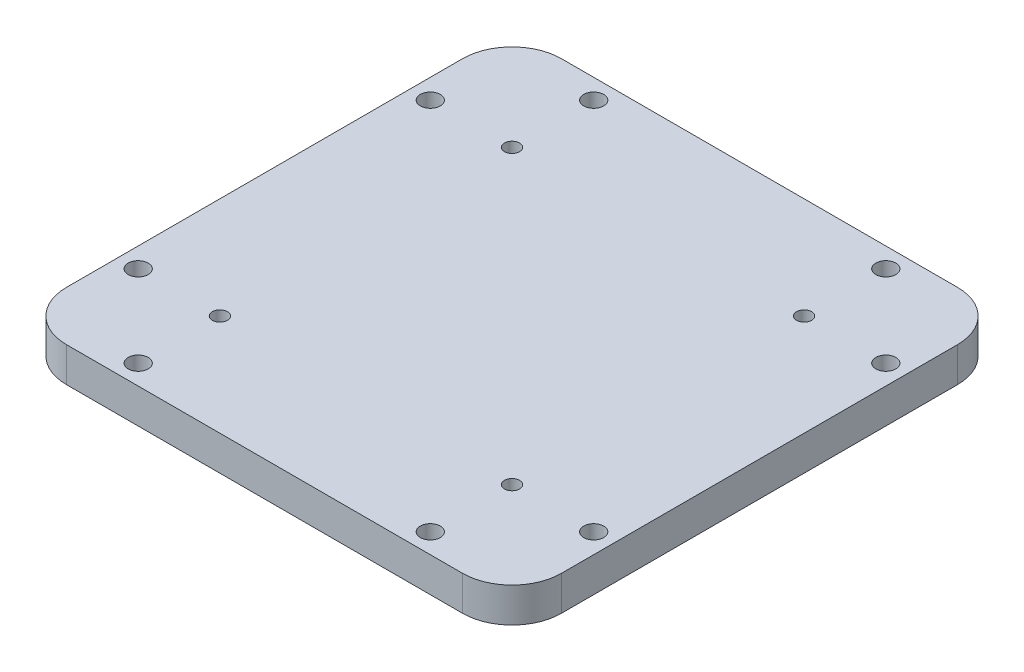
ISO-10303-21;
HEADER;
FILE_DESCRIPTION(('STEP AP214'),'2;1');
FILE_NAME('part.step','',(''),(''),'','','');
FILE_SCHEMA(('AUTOMOTIVE_DESIGN { 1 0 10303 214 1 1 1 1 }'));
ENDSEC;
DATA;
#1=APPLICATION_CONTEXT('core data for automotive mechanical design processes');
#2=APPLICATION_PROTOCOL_DEFINITION('international standard','automotive_design',2000,#1);
#3=PRODUCT_CONTEXT('',#1,'mechanical');
#4=PRODUCT('Part','Part','',(#3));
#5=PRODUCT_RELATED_PRODUCT_CATEGORY('part','',(#4));
#6=PRODUCT_DEFINITION_FORMATION('','',#4);
#7=PRODUCT_DEFINITION_CONTEXT('part definition',#1,'design');
#8=PRODUCT_DEFINITION('design','',#6,#7);
#9=PRODUCT_DEFINITION_SHAPE('','',#8);
#10=(LENGTH_UNIT() NAMED_UNIT(*) SI_UNIT(.MILLI.,.METRE.));
#11=(NAMED_UNIT(*) PLANE_ANGLE_UNIT() SI_UNIT($,.RADIAN.));
#12=(NAMED_UNIT(*) SI_UNIT($,.STERADIAN.) SOLID_ANGLE_UNIT());
#13=UNCERTAINTY_MEASURE_WITH_UNIT(LENGTH_MEASURE(1.E-05),#10,'distance_accuracy_value','');
#14=(GEOMETRIC_REPRESENTATION_CONTEXT(3) GLOBAL_UNCERTAINTY_ASSIGNED_CONTEXT((#13)) GLOBAL_UNIT_ASSIGNED_CONTEXT((#10,
#11,#12)) REPRESENTATION_CONTEXT('',''));
#15=CARTESIAN_POINT('',(0.,0.,0.));
#16=DIRECTION('',(0.,0.,1.));
#17=DIRECTION('',(1.,0.,0.));
#18=AXIS2_PLACEMENT_3D('',#15,#16,#17);
#19=CARTESIAN_POINT('',(0.,7.,0.));
#20=DIRECTION('',(0.,1.,0.));
#21=DIRECTION('',(0.,0.,1.));
#22=AXIS2_PLACEMENT_3D('',#19,#20,#21);
#23=PLANE('',#22);
#24=CARTESIAN_POINT('',(79.5,7.,-96.));
#25=DIRECTION('',(0.,1.,0.));
#26=DIRECTION('',(0.,0.,1.));
#27=AXIS2_PLACEMENT_3D('',#24,#25,#26);
#28=CIRCLE('',#27,2.02);
#29=CARTESIAN_POINT('',(79.5,7.,-93.98));
#30=VERTEX_POINT('',#29);
#31=EDGE_CURVE('E224',#30,#30,#28,.F.);
#32=ORIENTED_EDGE('',*,*,#31,.T.);
#33=EDGE_LOOP('',(#32));
#34=FACE_BOUND('',#33,.T.);
#35=CARTESIAN_POINT('',(20.5,7.,-20.5));
#36=DIRECTION('',(0.,1.,0.));
#37=DIRECTION('',(0.,0.,1.));
#38=AXIS2_PLACEMENT_3D('',#35,#36,#37);
#39=CIRCLE('',#38,1.52);
#40=CARTESIAN_POINT('',(20.5,7.,-18.98));
#41=VERTEX_POINT('',#40);
#42=EDGE_CURVE('E245',#41,#41,#39,.F.);
#43=ORIENTED_EDGE('',*,*,#42,.T.);
#44=EDGE_LOOP('',(#43));
#45=FACE_BOUND('',#44,.T.);
#46=CARTESIAN_POINT('',(20.5,7.,-4.));
#47=DIRECTION('',(0.,1.,0.));
#48=DIRECTION('',(0.,0.,1.));
#49=AXIS2_PLACEMENT_3D('',#46,#47,#48);
#50=CIRCLE('',#49,2.02);
#51=CARTESIAN_POINT('',(20.5,7.,-1.98));
#52=VERTEX_POINT('',#51);
#53=EDGE_CURVE('E248',#52,#52,#50,.F.);
#54=ORIENTED_EDGE('',*,*,#53,.T.);
#55=EDGE_LOOP('',(#54));
#56=FACE_BOUND('',#55,.T.);
#57=CARTESIAN_POINT('',(4.,7.,-79.5));
#58=DIRECTION('',(0.,1.,0.));
#59=DIRECTION('',(0.,0.,1.));
#60=AXIS2_PLACEMENT_3D('',#57,#58,#59);
#61=CIRCLE('',#60,2.02);
#62=CARTESIAN_POINT('',(4.,7.,-77.48));
#63=VERTEX_POINT('',#62);
#64=EDGE_CURVE('E164',#63,#63,#61,.T.);
#65=ORIENTED_EDGE('',*,*,#64,.F.);
#66=EDGE_LOOP('',(#65));
#67=FACE_BOUND('',#66,.T.);
#68=DIRECTION('',(1.,0.,0.));
#69=VECTOR('',#68,1.);
#70=CARTESIAN_POINT('',(0.,7.,-100.));
#71=LINE('',#70,#69);
#72=CARTESIAN_POINT('',(10.,7.,-100.));
#73=VERTEX_POINT('',#72);
#74=CARTESIAN_POINT('',(90.,7.,-100.));
#75=VERTEX_POINT('',#74);
#76=EDGE_CURVE('E135',#73,#75,#71,.T.);
#77=ORIENTED_EDGE('',*,*,#76,.F.);
#78=CARTESIAN_POINT('',(10.,7.,-90.));
#79=DIRECTION('',(0.,1.,0.));
#80=DIRECTION('',(0.,0.,1.));
#81=AXIS2_PLACEMENT_3D('',#78,#79,#80);
#82=CIRCLE('',#81,10.);
#83=CARTESIAN_POINT('',(0.,7.,-90.));
#84=VERTEX_POINT('',#83);
#85=EDGE_CURVE('E153',#73,#84,#82,.T.);
#86=ORIENTED_EDGE('',*,*,#85,.T.);
#87=DIRECTION('',(0.,0.,-1.));
#88=VECTOR('',#87,1.);
#89=CARTESIAN_POINT('',(0.,7.,0.));
#90=LINE('',#89,#88);
#91=CARTESIAN_POINT('',(0.,7.,-10.));
#92=VERTEX_POINT('',#91);
#93=EDGE_CURVE('E132',#92,#84,#90,.T.);
#94=ORIENTED_EDGE('',*,*,#93,.F.);
#95=CARTESIAN_POINT('',(10.,7.,-10.));
#96=DIRECTION('',(0.,1.,0.));
#97=DIRECTION('',(0.,0.,1.));
#98=AXIS2_PLACEMENT_3D('',#95,#96,#97);
#99=CIRCLE('',#98,10.);
#100=CARTESIAN_POINT('',(10.,7.,0.));
#101=VERTEX_POINT('',#100);
#102=EDGE_CURVE('E131',#92,#101,#99,.T.);
#103=ORIENTED_EDGE('',*,*,#102,.T.);
#104=DIRECTION('',(1.,0.,0.));
#105=VECTOR('',#104,1.);
#106=CARTESIAN_POINT('',(0.,7.,0.));
#107=LINE('',#106,#105);
#108=CARTESIAN_POINT('',(90.,7.,0.));
#109=VERTEX_POINT('',#108);
#110=EDGE_CURVE('E127',#101,#109,#107,.T.);
#111=ORIENTED_EDGE('',*,*,#110,.T.);
#112=CARTESIAN_POINT('',(90.0000000000001,7.,-10.));
#113=DIRECTION('',(0.,1.,0.));
#114=DIRECTION('',(0.,0.,1.));
#115=AXIS2_PLACEMENT_3D('',#112,#113,#114);
#116=CIRCLE('',#115,10.);
#117=CARTESIAN_POINT('',(100.,7.,-10.));
#118=VERTEX_POINT('',#117);
#119=EDGE_CURVE('E62',#109,#118,#116,.T.);
#120=ORIENTED_EDGE('',*,*,#119,.T.);
#121=DIRECTION('',(0.,0.,-1.));
#122=VECTOR('',#121,1.);
#123=CARTESIAN_POINT('',(100.,7.,0.));
#124=LINE('',#123,#122);
#125=CARTESIAN_POINT('',(100.,7.,-90.));
#126=VERTEX_POINT('',#125);
#127=EDGE_CURVE('E217',#118,#126,#124,.T.);
#128=ORIENTED_EDGE('',*,*,#127,.T.);
#129=CARTESIAN_POINT('',(90.,7.,-90.));
#130=DIRECTION('',(0.,1.,0.));
#131=DIRECTION('',(0.,0.,1.));
#132=AXIS2_PLACEMENT_3D('',#129,#130,#131);
#133=CIRCLE('',#132,10.);
#134=EDGE_CURVE('E151',#126,#75,#133,.T.);
#135=ORIENTED_EDGE('',*,*,#134,.T.);
#136=EDGE_LOOP('',(#77,#86,#94,#103,#111,#120,#128,#135));
#137=FACE_BOUND('',#136,.T.);
#138=CARTESIAN_POINT('',(4.,7.,-20.5));
#139=DIRECTION('',(0.,1.,0.));
#140=DIRECTION('',(0.,0.,1.));
#141=AXIS2_PLACEMENT_3D('',#138,#139,#140);
#142=CIRCLE('',#141,2.02);
#143=CARTESIAN_POINT('',(4.,7.,-18.48));
#144=VERTEX_POINT('',#143);
#145=EDGE_CURVE('E251',#144,#144,#142,.F.);
#146=ORIENTED_EDGE('',*,*,#145,.T.);
#147=EDGE_LOOP('',(#146));
#148=FACE_BOUND('',#147,.T.);
#149=CARTESIAN_POINT('',(20.5,7.,-96.));
#150=DIRECTION('',(0.,1.,0.));
#151=DIRECTION('',(0.,0.,1.));
#152=AXIS2_PLACEMENT_3D('',#149,#150,#151);
#153=CIRCLE('',#152,2.02);
#154=CARTESIAN_POINT('',(20.5,7.,-93.98));
#155=VERTEX_POINT('',#154);
#156=EDGE_CURVE('E223',#155,#155,#153,.T.);
#157=ORIENTED_EDGE('',*,*,#156,.F.);
#158=EDGE_LOOP('',(#157));
#159=FACE_BOUND('',#158,.T.);
#160=CARTESIAN_POINT('',(20.5,7.,-79.5));
#161=DIRECTION('',(0.,1.,0.));
#162=DIRECTION('',(0.,0.,1.));
#163=AXIS2_PLACEMENT_3D('',#160,#161,#162);
#164=CIRCLE('',#163,1.52);
#165=CARTESIAN_POINT('',(20.5,7.,-77.98));
#166=VERTEX_POINT('',#165);
#167=EDGE_CURVE('E231',#166,#166,#164,.T.);
#168=ORIENTED_EDGE('',*,*,#167,.F.);
#169=EDGE_LOOP('',(#168));
#170=FACE_BOUND('',#169,.T.);
#171=CARTESIAN_POINT('',(79.5,7.,-79.5));
#172=DIRECTION('',(0.,1.,0.));
#173=DIRECTION('',(0.,0.,1.));
#174=AXIS2_PLACEMENT_3D('',#171,#172,#173);
#175=CIRCLE('',#174,1.51999999999999);
#176=CARTESIAN_POINT('',(79.5,7.,-77.98));
#177=VERTEX_POINT('',#176);
#178=EDGE_CURVE('E227',#177,#177,#175,.F.);
#179=ORIENTED_EDGE('',*,*,#178,.T.);
#180=EDGE_LOOP('',(#179));
#181=FACE_BOUND('',#180,.T.);
#182=CARTESIAN_POINT('',(79.5,7.,-4.00000000000001));
#183=DIRECTION('',(0.,1.,0.));
#184=DIRECTION('',(0.,0.,1.));
#185=AXIS2_PLACEMENT_3D('',#182,#183,#184);
#186=CIRCLE('',#185,2.02);
#187=CARTESIAN_POINT('',(79.5,7.,-1.98000000000001));
#188=VERTEX_POINT('',#187);
#189=EDGE_CURVE('E242',#188,#188,#186,.T.);
#190=ORIENTED_EDGE('',*,*,#189,.F.);
#191=EDGE_LOOP('',(#190));
#192=FACE_BOUND('',#191,.T.);
#193=CARTESIAN_POINT('',(96.,7.,-20.5));
#194=DIRECTION('',(0.,1.,0.));
#195=DIRECTION('',(0.,0.,1.));
#196=AXIS2_PLACEMENT_3D('',#193,#194,#195);
#197=CIRCLE('',#196,2.02);
#198=CARTESIAN_POINT('',(96.,7.,-18.48));
#199=VERTEX_POINT('',#198);
#200=EDGE_CURVE('E239',#199,#199,#197,.T.);
#201=ORIENTED_EDGE('',*,*,#200,.F.);
#202=EDGE_LOOP('',(#201));
#203=FACE_BOUND('',#202,.T.);
#204=CARTESIAN_POINT('',(79.5,7.,-20.5));
#205=DIRECTION('',(0.,1.,0.));
#206=DIRECTION('',(0.,0.,1.));
#207=AXIS2_PLACEMENT_3D('',#204,#205,#206);
#208=CIRCLE('',#207,1.52000000000001);
#209=CARTESIAN_POINT('',(79.5,7.,-18.98));
#210=VERTEX_POINT('',#209);
#211=EDGE_CURVE('E236',#210,#210,#208,.T.);
#212=ORIENTED_EDGE('',*,*,#211,.F.);
#213=EDGE_LOOP('',(#212));
#214=FACE_BOUND('',#213,.T.);
#215=CARTESIAN_POINT('',(96.,7.,-79.5));
#216=DIRECTION('',(0.,1.,0.));
#217=DIRECTION('',(0.,0.,1.));
#218=AXIS2_PLACEMENT_3D('',#215,#216,#217);
#219=CIRCLE('',#218,2.02);
#220=CARTESIAN_POINT('',(96.,7.,-77.48));
#221=VERTEX_POINT('',#220);
#222=EDGE_CURVE('E228',#221,#221,#219,.F.);
#223=ORIENTED_EDGE('',*,*,#222,.T.);
#224=EDGE_LOOP('',(#223));
#225=FACE_BOUND('',#224,.T.);
#226=ADVANCED_FACE('F38',(#34,#45,#56,#67,#137,#148,#159,#170,#181,#192,#203,#214,#225),#23,.T.);
#227=CARTESIAN_POINT('',(0.,0.,0.));
#228=DIRECTION('',(0.,1.,0.));
#229=DIRECTION('',(0.,0.,1.));
#230=AXIS2_PLACEMENT_3D('',#227,#228,#229);
#231=PLANE('',#230);
#232=CARTESIAN_POINT('',(79.5,0.,-20.5));
#233=DIRECTION('',(0.,1.,0.));
#234=DIRECTION('',(0.,0.,1.));
#235=AXIS2_PLACEMENT_3D('',#232,#233,#234);
#236=CIRCLE('',#235,1.52000000000001);
#237=CARTESIAN_POINT('',(79.5,0.,-18.98));
#238=VERTEX_POINT('',#237);
#239=EDGE_CURVE('E190',#238,#238,#236,.T.);
#240=ORIENTED_EDGE('',*,*,#239,.T.);
#241=EDGE_LOOP('',(#240));
#242=FACE_BOUND('',#241,.T.);
#243=CARTESIAN_POINT('',(96.,0.,-20.5));
#244=DIRECTION('',(0.,1.,0.));
#245=DIRECTION('',(0.,0.,1.));
#246=AXIS2_PLACEMENT_3D('',#243,#244,#245);
#247=CIRCLE('',#246,2.02);
#248=CARTESIAN_POINT('',(96.,0.,-18.48));
#249=VERTEX_POINT('',#248);
#250=EDGE_CURVE('E188',#249,#249,#247,.T.);
#251=ORIENTED_EDGE('',*,*,#250,.T.);
#252=EDGE_LOOP('',(#251));
#253=FACE_BOUND('',#252,.T.);
#254=CARTESIAN_POINT('',(79.5,0.,-4.00000000000001));
#255=DIRECTION('',(0.,1.,0.));
#256=DIRECTION('',(0.,0.,1.));
#257=AXIS2_PLACEMENT_3D('',#254,#255,#256);
#258=CIRCLE('',#257,2.02);
#259=CARTESIAN_POINT('',(79.5,0.,-1.98000000000001));
#260=VERTEX_POINT('',#259);
#261=EDGE_CURVE('E185',#260,#260,#258,.T.);
#262=ORIENTED_EDGE('',*,*,#261,.T.);
#263=EDGE_LOOP('',(#262));
#264=FACE_BOUND('',#263,.T.);
#265=CARTESIAN_POINT('',(20.5,0.,-79.5));
#266=DIRECTION('',(0.,1.,0.));
#267=DIRECTION('',(0.,0.,1.));
#268=AXIS2_PLACEMENT_3D('',#265,#266,#267);
#269=CIRCLE('',#268,1.52);
#270=CARTESIAN_POINT('',(20.5,0.,-77.98));
#271=VERTEX_POINT('',#270);
#272=EDGE_CURVE('E176',#271,#271,#269,.T.);
#273=ORIENTED_EDGE('',*,*,#272,.T.);
#274=EDGE_LOOP('',(#273));
#275=FACE_BOUND('',#274,.T.);
#276=CARTESIAN_POINT('',(20.5,0.,-96.));
#277=DIRECTION('',(0.,1.,0.));
#278=DIRECTION('',(0.,0.,1.));
#279=AXIS2_PLACEMENT_3D('',#276,#277,#278);
#280=CIRCLE('',#279,2.02);
#281=CARTESIAN_POINT('',(20.5,0.,-93.98));
#282=VERTEX_POINT('',#281);
#283=EDGE_CURVE('E173',#282,#282,#280,.T.);
#284=ORIENTED_EDGE('',*,*,#283,.T.);
#285=EDGE_LOOP('',(#284));
#286=FACE_BOUND('',#285,.T.);
#287=CARTESIAN_POINT('',(4.,0.,-79.5));
#288=DIRECTION('',(0.,1.,0.));
#289=DIRECTION('',(0.,0.,1.));
#290=AXIS2_PLACEMENT_3D('',#287,#288,#289);
#291=CIRCLE('',#290,2.02);
#292=CARTESIAN_POINT('',(4.,0.,-77.48));
#293=VERTEX_POINT('',#292);
#294=EDGE_CURVE('E160',#293,#293,#291,.T.);
#295=ORIENTED_EDGE('',*,*,#294,.T.);
#296=EDGE_LOOP('',(#295));
#297=FACE_BOUND('',#296,.T.);
#298=DIRECTION('',(0.,0.,-1.));
#299=VECTOR('',#298,1.);
#300=CARTESIAN_POINT('',(0.,0.,0.));
#301=LINE('',#300,#299);
#302=CARTESIAN_POINT('',(0.,0.,-10.));
#303=VERTEX_POINT('',#302);
#304=CARTESIAN_POINT('',(0.,0.,-90.));
#305=VERTEX_POINT('',#304);
#306=EDGE_CURVE('E110',#303,#305,#301,.T.);
#307=ORIENTED_EDGE('',*,*,#306,.T.);
#308=CARTESIAN_POINT('',(10.,0.,-90.));
#309=DIRECTION('',(0.,1.,0.));
#310=DIRECTION('',(0.,0.,1.));
#311=AXIS2_PLACEMENT_3D('',#308,#309,#310);
#312=CIRCLE('',#311,10.);
#313=CARTESIAN_POINT('',(10.,0.,-100.));
#314=VERTEX_POINT('',#313);
#315=EDGE_CURVE('E142',#305,#314,#312,.F.);
#316=ORIENTED_EDGE('',*,*,#315,.T.);
#317=DIRECTION('',(1.,0.,0.));
#318=VECTOR('',#317,1.);
#319=CARTESIAN_POINT('',(0.,0.,-100.));
#320=LINE('',#319,#318);
#321=CARTESIAN_POINT('',(90.,0.,-100.));
#322=VERTEX_POINT('',#321);
#323=EDGE_CURVE('E128',#314,#322,#320,.T.);
#324=ORIENTED_EDGE('',*,*,#323,.T.);
#325=CARTESIAN_POINT('',(90.,0.,-90.));
#326=DIRECTION('',(0.,1.,0.));
#327=DIRECTION('',(0.,0.,1.));
#328=AXIS2_PLACEMENT_3D('',#325,#326,#327);
#329=CIRCLE('',#328,10.);
#330=CARTESIAN_POINT('',(100.,0.,-90.));
#331=VERTEX_POINT('',#330);
#332=EDGE_CURVE('E140',#322,#331,#329,.F.);
#333=ORIENTED_EDGE('',*,*,#332,.T.);
#334=DIRECTION('',(0.,0.,-1.));
#335=VECTOR('',#334,1.);
#336=CARTESIAN_POINT('',(100.,0.,0.));
#337=LINE('',#336,#335);
#338=CARTESIAN_POINT('',(100.,0.,-10.));
#339=VERTEX_POINT('',#338);
#340=EDGE_CURVE('E197',#339,#331,#337,.T.);
#341=ORIENTED_EDGE('',*,*,#340,.F.);
#342=CARTESIAN_POINT('',(90.0000000000001,0.,-10.));
#343=DIRECTION('',(0.,1.,0.));
#344=DIRECTION('',(0.,0.,1.));
#345=AXIS2_PLACEMENT_3D('',#342,#343,#344);
#346=CIRCLE('',#345,10.);
#347=CARTESIAN_POINT('',(90.,0.,0.));
#348=VERTEX_POINT('',#347);
#349=EDGE_CURVE('E117',#339,#348,#346,.F.);
#350=ORIENTED_EDGE('',*,*,#349,.T.);
#351=DIRECTION('',(1.,0.,0.));
#352=VECTOR('',#351,1.);
#353=CARTESIAN_POINT('',(0.,0.,0.));
#354=LINE('',#353,#352);
#355=CARTESIAN_POINT('',(10.,0.,0.));
#356=VERTEX_POINT('',#355);
#357=EDGE_CURVE('E112',#356,#348,#354,.T.);
#358=ORIENTED_EDGE('',*,*,#357,.F.);
#359=CARTESIAN_POINT('',(10.,0.,-10.));
#360=DIRECTION('',(0.,1.,0.));
#361=DIRECTION('',(0.,0.,1.));
#362=AXIS2_PLACEMENT_3D('',#359,#360,#361);
#363=CIRCLE('',#362,10.);
#364=EDGE_CURVE('E106',#356,#303,#363,.F.);
#365=ORIENTED_EDGE('',*,*,#364,.T.);
#366=EDGE_LOOP('',(#307,#316,#324,#333,#341,#350,#358,#365));
#367=FACE_BOUND('',#366,.T.);
#368=CARTESIAN_POINT('',(20.5,0.,-4.));
#369=DIRECTION('',(0.,1.,0.));
#370=DIRECTION('',(0.,0.,1.));
#371=AXIS2_PLACEMENT_3D('',#368,#369,#370);
#372=CIRCLE('',#371,2.02);
#373=CARTESIAN_POINT('',(20.5,0.,-1.98));
#374=VERTEX_POINT('',#373);
#375=EDGE_CURVE('E163',#374,#374,#372,.F.);
#376=ORIENTED_EDGE('',*,*,#375,.F.);
#377=EDGE_LOOP('',(#376));
#378=FACE_BOUND('',#377,.T.);
#379=CARTESIAN_POINT('',(4.,0.,-20.5));
#380=DIRECTION('',(0.,1.,0.));
#381=DIRECTION('',(0.,0.,1.));
#382=AXIS2_PLACEMENT_3D('',#379,#380,#381);
#383=CIRCLE('',#382,2.02);
#384=CARTESIAN_POINT('',(4.,0.,-18.48));
#385=VERTEX_POINT('',#384);
#386=EDGE_CURVE('E167',#385,#385,#383,.F.);
#387=ORIENTED_EDGE('',*,*,#386,.F.);
#388=EDGE_LOOP('',(#387));
#389=FACE_BOUND('',#388,.T.);
#390=CARTESIAN_POINT('',(20.5,0.,-20.5));
#391=DIRECTION('',(0.,1.,0.));
#392=DIRECTION('',(0.,0.,1.));
#393=AXIS2_PLACEMENT_3D('',#390,#391,#392);
#394=CIRCLE('',#393,1.52);
#395=CARTESIAN_POINT('',(20.5,0.,-18.98));
#396=VERTEX_POINT('',#395);
#397=EDGE_CURVE('E170',#396,#396,#394,.F.);
#398=ORIENTED_EDGE('',*,*,#397,.F.);
#399=EDGE_LOOP('',(#398));
#400=FACE_BOUND('',#399,.T.);
#401=CARTESIAN_POINT('',(79.5,0.,-79.5));
#402=DIRECTION('',(0.,1.,0.));
#403=DIRECTION('',(0.,0.,1.));
#404=AXIS2_PLACEMENT_3D('',#401,#402,#403);
#405=CIRCLE('',#404,1.51999999999999);
#406=CARTESIAN_POINT('',(79.5,0.,-77.98));
#407=VERTEX_POINT('',#406);
#408=EDGE_CURVE('E179',#407,#407,#405,.F.);
#409=ORIENTED_EDGE('',*,*,#408,.F.);
#410=EDGE_LOOP('',(#409));
#411=FACE_BOUND('',#410,.T.);
#412=CARTESIAN_POINT('',(79.5,0.,-96.));
#413=DIRECTION('',(0.,1.,0.));
#414=DIRECTION('',(0.,0.,1.));
#415=AXIS2_PLACEMENT_3D('',#412,#413,#414);
#416=CIRCLE('',#415,2.02);
#417=CARTESIAN_POINT('',(79.5,0.,-93.98));
#418=VERTEX_POINT('',#417);
#419=EDGE_CURVE('E182',#418,#418,#416,.F.);
#420=ORIENTED_EDGE('',*,*,#419,.F.);
#421=EDGE_LOOP('',(#420));
#422=FACE_BOUND('',#421,.T.);
#423=CARTESIAN_POINT('',(96.,0.,-79.5));
#424=DIRECTION('',(0.,1.,0.));
#425=DIRECTION('',(0.,0.,1.));
#426=AXIS2_PLACEMENT_3D('',#423,#424,#425);
#427=CIRCLE('',#426,2.02);
#428=CARTESIAN_POINT('',(96.,0.,-77.48));
#429=VERTEX_POINT('',#428);
#430=EDGE_CURVE('E42',#429,#429,#427,.F.);
#431=ORIENTED_EDGE('',*,*,#430,.F.);
#432=EDGE_LOOP('',(#431));
#433=FACE_BOUND('',#432,.T.);
#434=ADVANCED_FACE('F108',(#242,#253,#264,#275,#286,#297,#367,#378,#389,#400,#411,#422,#433),
#231,.F.);
#435=CARTESIAN_POINT('',(0.,7.,0.));
#436=DIRECTION('',(0.,0.,-1.));
#437=DIRECTION('',(-1.,0.,0.));
#438=AXIS2_PLACEMENT_3D('',#435,#436,#437);
#439=PLANE('',#438);
#440=ORIENTED_EDGE('',*,*,#357,.T.);
#441=DIRECTION('',(0.,-1.,0.));
#442=VECTOR('',#441,1.);
#443=CARTESIAN_POINT('',(90.0000000000001,7.,0.));
#444=LINE('',#443,#442);
#445=EDGE_CURVE('E11',#348,#109,#444,.F.);
#446=ORIENTED_EDGE('',*,*,#445,.T.);
#447=ORIENTED_EDGE('',*,*,#110,.F.);
#448=DIRECTION('',(0.,-1.,0.));
#449=VECTOR('',#448,1.);
#450=CARTESIAN_POINT('',(10.,0.,0.));
#451=LINE('',#450,#449);
#452=EDGE_CURVE('E47',#101,#356,#451,.T.);
#453=ORIENTED_EDGE('',*,*,#452,.T.);
#454=EDGE_LOOP('',(#440,#446,#447,#453));
#455=FACE_BOUND('',#454,.T.);
#456=ADVANCED_FACE('F269',(#455),#439,.F.);
#457=CARTESIAN_POINT('',(100.,7.,0.));
#458=DIRECTION('',(-1.,0.,0.));
#459=DIRECTION('',(0.,0.,1.));
#460=AXIS2_PLACEMENT_3D('',#457,#458,#459);
#461=PLANE('',#460);
#462=ORIENTED_EDGE('',*,*,#340,.T.);
#463=DIRECTION('',(0.,-1.,0.));
#464=VECTOR('',#463,1.);
#465=CARTESIAN_POINT('',(100.,7.,-90.));
#466=LINE('',#465,#464);
#467=EDGE_CURVE('E55',#331,#126,#466,.F.);
#468=ORIENTED_EDGE('',*,*,#467,.T.);
#469=ORIENTED_EDGE('',*,*,#127,.F.);
#470=DIRECTION('',(0.,-1.,0.));
#471=VECTOR('',#470,1.);
#472=CARTESIAN_POINT('',(100.,7.,-10.));
#473=LINE('',#472,#471);
#474=EDGE_CURVE('E155',#118,#339,#473,.T.);
#475=ORIENTED_EDGE('',*,*,#474,.T.);
#476=EDGE_LOOP('',(#462,#468,#469,#475));
#477=FACE_BOUND('',#476,.T.);
#478=ADVANCED_FACE('F305',(#477),#461,.F.);
#479=CARTESIAN_POINT('',(0.,7.,-100.));
#480=DIRECTION('',(0.,0.,-1.));
#481=DIRECTION('',(-1.,0.,0.));
#482=AXIS2_PLACEMENT_3D('',#479,#480,#481);
#483=PLANE('',#482);
#484=ORIENTED_EDGE('',*,*,#323,.F.);
#485=DIRECTION('',(0.,-1.,0.));
#486=VECTOR('',#485,1.);
#487=CARTESIAN_POINT('',(10.,7.,-100.));
#488=LINE('',#487,#486);
#489=EDGE_CURVE('E147',#314,#73,#488,.F.);
#490=ORIENTED_EDGE('',*,*,#489,.T.);
#491=ORIENTED_EDGE('',*,*,#76,.T.);
#492=DIRECTION('',(0.,-1.,0.));
#493=VECTOR('',#492,1.);
#494=CARTESIAN_POINT('',(90.,0.,-100.));
#495=LINE('',#494,#493);
#496=EDGE_CURVE('E144',#75,#322,#495,.T.);
#497=ORIENTED_EDGE('',*,*,#496,.T.);
#498=EDGE_LOOP('',(#484,#490,#491,#497));
#499=FACE_BOUND('',#498,.T.);
#500=ADVANCED_FACE('F208',(#499),#483,.T.);
#501=CARTESIAN_POINT('',(0.,7.,0.));
#502=DIRECTION('',(-1.,0.,0.));
#503=DIRECTION('',(0.,0.,1.));
#504=AXIS2_PLACEMENT_3D('',#501,#502,#503);
#505=PLANE('',#504);
#506=ORIENTED_EDGE('',*,*,#93,.T.);
#507=DIRECTION('',(0.,-1.,0.));
#508=VECTOR('',#507,1.);
#509=CARTESIAN_POINT('',(0.,7.,-90.));
#510=LINE('',#509,#508);
#511=EDGE_CURVE('E118',#84,#305,#510,.T.);
#512=ORIENTED_EDGE('',*,*,#511,.T.);
#513=ORIENTED_EDGE('',*,*,#306,.F.);
#514=DIRECTION('',(0.,-1.,0.));
#515=VECTOR('',#514,1.);
#516=CARTESIAN_POINT('',(0.,7.,-10.));
#517=LINE('',#516,#515);
#518=EDGE_CURVE('E124',#303,#92,#517,.F.);
#519=ORIENTED_EDGE('',*,*,#518,.T.);
#520=EDGE_LOOP('',(#506,#512,#513,#519));
#521=FACE_BOUND('',#520,.T.);
#522=ADVANCED_FACE('F123',(#521),#505,.T.);
#523=CARTESIAN_POINT('',(10.,7.,-90.));
#524=DIRECTION('',(0.,-1.,0.));
#525=DIRECTION('',(0.,0.,-1.));
#526=AXIS2_PLACEMENT_3D('',#523,#524,#525);
#527=CYLINDRICAL_SURFACE('',#526,10.);
#528=ORIENTED_EDGE('',*,*,#85,.F.);
#529=ORIENTED_EDGE('',*,*,#489,.F.);
#530=ORIENTED_EDGE('',*,*,#315,.F.);
#531=ORIENTED_EDGE('',*,*,#511,.F.);
#532=EDGE_LOOP('',(#528,#529,#530,#531));
#533=FACE_BOUND('',#532,.T.);
#534=ADVANCED_FACE('F214',(#533),#527,.T.);
#535=CARTESIAN_POINT('',(90.,7.,-90.));
#536=DIRECTION('',(0.,1.,0.));
#537=DIRECTION('',(0.,0.,1.));
#538=AXIS2_PLACEMENT_3D('',#535,#536,#537);
#539=CYLINDRICAL_SURFACE('',#538,10.);
#540=ORIENTED_EDGE('',*,*,#134,.F.);
#541=ORIENTED_EDGE('',*,*,#467,.F.);
#542=ORIENTED_EDGE('',*,*,#332,.F.);
#543=ORIENTED_EDGE('',*,*,#496,.F.);
#544=EDGE_LOOP('',(#540,#541,#542,#543));
#545=FACE_BOUND('',#544,.T.);
#546=ADVANCED_FACE('F312',(#545),#539,.T.);
#547=CARTESIAN_POINT('',(90.0000000000001,7.,-10.));
#548=DIRECTION('',(0.,-1.,0.));
#549=DIRECTION('',(0.,0.,-1.));
#550=AXIS2_PLACEMENT_3D('',#547,#548,#549);
#551=CYLINDRICAL_SURFACE('',#550,10.);
#552=ORIENTED_EDGE('',*,*,#119,.F.);
#553=ORIENTED_EDGE('',*,*,#445,.F.);
#554=ORIENTED_EDGE('',*,*,#349,.F.);
#555=ORIENTED_EDGE('',*,*,#474,.F.);
#556=EDGE_LOOP('',(#552,#553,#554,#555));
#557=FACE_BOUND('',#556,.T.);
#558=ADVANCED_FACE('F314',(#557),#551,.T.);
#559=CARTESIAN_POINT('',(10.,7.,-10.));
#560=DIRECTION('',(0.,1.,0.));
#561=DIRECTION('',(0.,0.,1.));
#562=AXIS2_PLACEMENT_3D('',#559,#560,#561);
#563=CYLINDRICAL_SURFACE('',#562,10.);
#564=ORIENTED_EDGE('',*,*,#102,.F.);
#565=ORIENTED_EDGE('',*,*,#518,.F.);
#566=ORIENTED_EDGE('',*,*,#364,.F.);
#567=ORIENTED_EDGE('',*,*,#452,.F.);
#568=EDGE_LOOP('',(#564,#565,#566,#567));
#569=FACE_BOUND('',#568,.T.);
#570=ADVANCED_FACE('F40',(#569),#563,.T.);
#571=CARTESIAN_POINT('',(4.,-6.,-79.5));
#572=DIRECTION('',(0.,1.,0.));
#573=DIRECTION('',(0.,0.,1.));
#574=AXIS2_PLACEMENT_3D('',#571,#572,#573);
#575=CYLINDRICAL_SURFACE('',#574,2.02);
#576=ORIENTED_EDGE('',*,*,#64,.T.);
#577=EDGE_LOOP('',(#576));
#578=FACE_BOUND('',#577,.T.);
#579=ORIENTED_EDGE('',*,*,#294,.F.);
#580=EDGE_LOOP('',(#579));
#581=FACE_BOUND('',#580,.T.);
#582=ADVANCED_FACE('F299',(#578,#581),#575,.F.);
#583=CARTESIAN_POINT('',(20.5,-6.,-4.));
#584=DIRECTION('',(0.,1.,0.));
#585=DIRECTION('',(0.,0.,1.));
#586=AXIS2_PLACEMENT_3D('',#583,#584,#585);
#587=CYLINDRICAL_SURFACE('',#586,2.02);
#588=ORIENTED_EDGE('',*,*,#53,.F.);
#589=EDGE_LOOP('',(#588));
#590=FACE_BOUND('',#589,.T.);
#591=ORIENTED_EDGE('',*,*,#375,.T.);
#592=EDGE_LOOP('',(#591));
#593=FACE_BOUND('',#592,.T.);
#594=ADVANCED_FACE('F326',(#590,#593),#587,.F.);
#595=CARTESIAN_POINT('',(4.,-6.,-20.5));
#596=DIRECTION('',(0.,1.,0.));
#597=DIRECTION('',(0.,0.,1.));
#598=AXIS2_PLACEMENT_3D('',#595,#596,#597);
#599=CYLINDRICAL_SURFACE('',#598,2.02);
#600=ORIENTED_EDGE('',*,*,#145,.F.);
#601=EDGE_LOOP('',(#600));
#602=FACE_BOUND('',#601,.T.);
#603=ORIENTED_EDGE('',*,*,#386,.T.);
#604=EDGE_LOOP('',(#603));
#605=FACE_BOUND('',#604,.T.);
#606=ADVANCED_FACE('F263',(#602,#605),#599,.F.);
#607=CARTESIAN_POINT('',(20.5,-6.,-20.5));
#608=DIRECTION('',(0.,1.,0.));
#609=DIRECTION('',(0.,0.,1.));
#610=AXIS2_PLACEMENT_3D('',#607,#608,#609);
#611=CYLINDRICAL_SURFACE('',#610,1.52);
#612=ORIENTED_EDGE('',*,*,#42,.F.);
#613=EDGE_LOOP('',(#612));
#614=FACE_BOUND('',#613,.T.);
#615=ORIENTED_EDGE('',*,*,#397,.T.);
#616=EDGE_LOOP('',(#615));
#617=FACE_BOUND('',#616,.T.);
#618=ADVANCED_FACE('F259',(#614,#617),#611,.F.);
#619=CARTESIAN_POINT('',(20.5,-6.,-96.));
#620=DIRECTION('',(0.,1.,0.));
#621=DIRECTION('',(0.,0.,1.));
#622=AXIS2_PLACEMENT_3D('',#619,#620,#621);
#623=CYLINDRICAL_SURFACE('',#622,2.02);
#624=ORIENTED_EDGE('',*,*,#156,.T.);
#625=EDGE_LOOP('',(#624));
#626=FACE_BOUND('',#625,.T.);
#627=ORIENTED_EDGE('',*,*,#283,.F.);
#628=EDGE_LOOP('',(#627));
#629=FACE_BOUND('',#628,.T.);
#630=ADVANCED_FACE('F262',(#626,#629),#623,.F.);
#631=CARTESIAN_POINT('',(20.5,-6.,-79.5));
#632=DIRECTION('',(0.,1.,0.));
#633=DIRECTION('',(0.,0.,1.));
#634=AXIS2_PLACEMENT_3D('',#631,#632,#633);
#635=CYLINDRICAL_SURFACE('',#634,1.52);
#636=ORIENTED_EDGE('',*,*,#167,.T.);
#637=EDGE_LOOP('',(#636));
#638=FACE_BOUND('',#637,.T.);
#639=ORIENTED_EDGE('',*,*,#272,.F.);
#640=EDGE_LOOP('',(#639));
#641=FACE_BOUND('',#640,.T.);
#642=ADVANCED_FACE('F289',(#638,#641),#635,.F.);
#643=CARTESIAN_POINT('',(79.5,-6.,-79.5));
#644=DIRECTION('',(0.,1.,0.));
#645=DIRECTION('',(0.,0.,1.));
#646=AXIS2_PLACEMENT_3D('',#643,#644,#645);
#647=CYLINDRICAL_SURFACE('',#646,1.51999999999999);
#648=ORIENTED_EDGE('',*,*,#178,.F.);
#649=EDGE_LOOP('',(#648));
#650=FACE_BOUND('',#649,.T.);
#651=ORIENTED_EDGE('',*,*,#408,.T.);
#652=EDGE_LOOP('',(#651));
#653=FACE_BOUND('',#652,.T.);
#654=ADVANCED_FACE('F279',(#650,#653),#647,.F.);
#655=CARTESIAN_POINT('',(79.5,-6.,-96.));
#656=DIRECTION('',(0.,1.,0.));
#657=DIRECTION('',(0.,0.,1.));
#658=AXIS2_PLACEMENT_3D('',#655,#656,#657);
#659=CYLINDRICAL_SURFACE('',#658,2.02);
#660=ORIENTED_EDGE('',*,*,#31,.F.);
#661=EDGE_LOOP('',(#660));
#662=FACE_BOUND('',#661,.T.);
#663=ORIENTED_EDGE('',*,*,#419,.T.);
#664=EDGE_LOOP('',(#663));
#665=FACE_BOUND('',#664,.T.);
#666=ADVANCED_FACE('F276',(#662,#665),#659,.F.);
#667=CARTESIAN_POINT('',(79.5,-6.,-4.00000000000001));
#668=DIRECTION('',(0.,1.,0.));
#669=DIRECTION('',(0.,0.,1.));
#670=AXIS2_PLACEMENT_3D('',#667,#668,#669);
#671=CYLINDRICAL_SURFACE('',#670,2.02);
#672=ORIENTED_EDGE('',*,*,#189,.T.);
#673=EDGE_LOOP('',(#672));
#674=FACE_BOUND('',#673,.T.);
#675=ORIENTED_EDGE('',*,*,#261,.F.);
#676=EDGE_LOOP('',(#675));
#677=FACE_BOUND('',#676,.T.);
#678=ADVANCED_FACE('F278',(#674,#677),#671,.F.);
#679=CARTESIAN_POINT('',(96.,-6.,-20.5));
#680=DIRECTION('',(0.,1.,0.));
#681=DIRECTION('',(0.,0.,1.));
#682=AXIS2_PLACEMENT_3D('',#679,#680,#681);
#683=CYLINDRICAL_SURFACE('',#682,2.02);
#684=ORIENTED_EDGE('',*,*,#200,.T.);
#685=EDGE_LOOP('',(#684));
#686=FACE_BOUND('',#685,.T.);
#687=ORIENTED_EDGE('',*,*,#250,.F.);
#688=EDGE_LOOP('',(#687));
#689=FACE_BOUND('',#688,.T.);
#690=ADVANCED_FACE('F286',(#686,#689),#683,.F.);
#691=CARTESIAN_POINT('',(79.5,-6.,-20.5));
#692=DIRECTION('',(0.,1.,0.));
#693=DIRECTION('',(0.,0.,1.));
#694=AXIS2_PLACEMENT_3D('',#691,#692,#693);
#695=CYLINDRICAL_SURFACE('',#694,1.52000000000001);
#696=ORIENTED_EDGE('',*,*,#211,.T.);
#697=EDGE_LOOP('',(#696));
#698=FACE_BOUND('',#697,.T.);
#699=ORIENTED_EDGE('',*,*,#239,.F.);
#700=EDGE_LOOP('',(#699));
#701=FACE_BOUND('',#700,.T.);
#702=ADVANCED_FACE('F347',(#698,#701),#695,.F.);
#703=CARTESIAN_POINT('',(96.,-6.,-79.5));
#704=DIRECTION('',(0.,1.,0.));
#705=DIRECTION('',(0.,0.,1.));
#706=AXIS2_PLACEMENT_3D('',#703,#704,#705);
#707=CYLINDRICAL_SURFACE('',#706,2.02);
#708=ORIENTED_EDGE('',*,*,#222,.F.);
#709=EDGE_LOOP('',(#708));
#710=FACE_BOUND('',#709,.T.);
#711=ORIENTED_EDGE('',*,*,#430,.T.);
#712=EDGE_LOOP('',(#711));
#713=FACE_BOUND('',#712,.T.);
#714=ADVANCED_FACE('F350',(#710,#713),#707,.F.);
#715=CLOSED_SHELL('',(#226,#434,#456,#478,#500,#522,#534,#546,#558,#570,#582,#594,#606,#618,
#630,#642,#654,#666,#678,#690,#702,#714));
#716=MANIFOLD_SOLID_BREP('B2',#715);
#717=ADVANCED_BREP_SHAPE_REPRESENTATION('',(#18,#716),#14);
#718=SHAPE_DEFINITION_REPRESENTATION(#9,#717);
ENDSEC;
END-ISO-10303-21;
